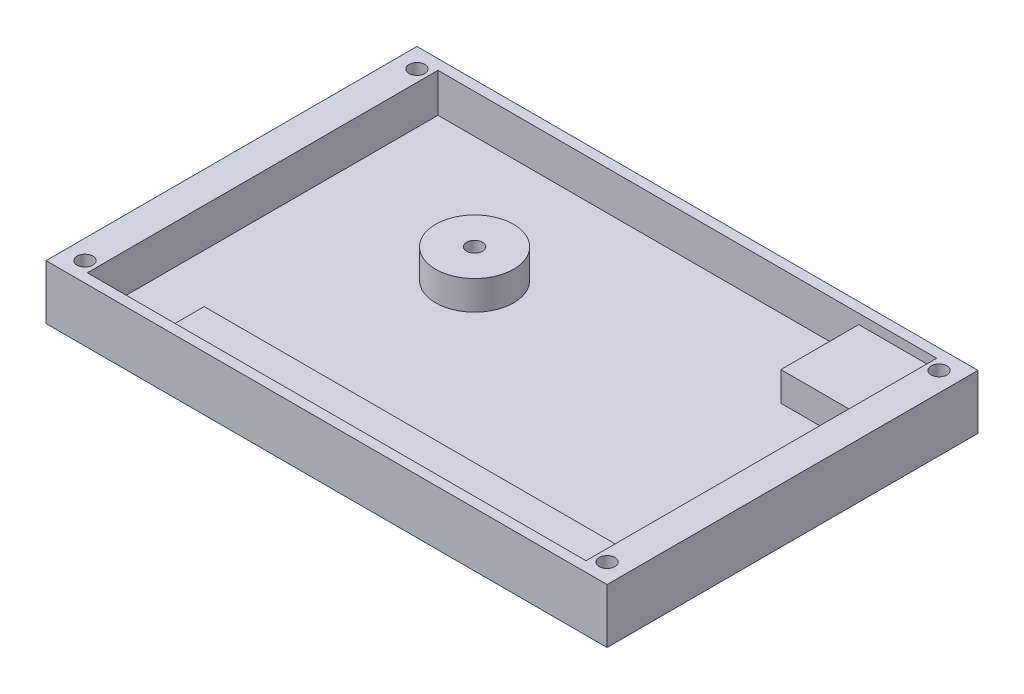
ISO-10303-21;
HEADER;
FILE_DESCRIPTION(('STEP AP214'),'2;1');
FILE_NAME('part.step','',(''),(''),'','','');
FILE_SCHEMA(('AUTOMOTIVE_DESIGN { 1 0 10303 214 1 1 1 1 }'));
ENDSEC;
DATA;
#1=APPLICATION_CONTEXT('core data for automotive mechanical design processes');
#2=APPLICATION_PROTOCOL_DEFINITION('international standard','automotive_design',2000,#1);
#3=PRODUCT_CONTEXT('',#1,'mechanical');
#4=PRODUCT('Part','Part','',(#3));
#5=PRODUCT_RELATED_PRODUCT_CATEGORY('part','',(#4));
#6=PRODUCT_DEFINITION_FORMATION('','',#4);
#7=PRODUCT_DEFINITION_CONTEXT('part definition',#1,'design');
#8=PRODUCT_DEFINITION('design','',#6,#7);
#9=PRODUCT_DEFINITION_SHAPE('','',#8);
#10=(LENGTH_UNIT() NAMED_UNIT(*) SI_UNIT(.MILLI.,.METRE.));
#11=(NAMED_UNIT(*) PLANE_ANGLE_UNIT() SI_UNIT($,.RADIAN.));
#12=(NAMED_UNIT(*) SI_UNIT($,.STERADIAN.) SOLID_ANGLE_UNIT());
#13=UNCERTAINTY_MEASURE_WITH_UNIT(LENGTH_MEASURE(1.E-05),#10,'distance_accuracy_value','');
#14=(GEOMETRIC_REPRESENTATION_CONTEXT(3) GLOBAL_UNCERTAINTY_ASSIGNED_CONTEXT((#13)) GLOBAL_UNIT_ASSIGNED_CONTEXT((#10,
#11,#12)) REPRESENTATION_CONTEXT('',''));
#15=CARTESIAN_POINT('',(0.,0.,0.));
#16=DIRECTION('',(0.,0.,1.));
#17=DIRECTION('',(1.,0.,0.));
#18=AXIS2_PLACEMENT_3D('',#15,#16,#17);
#19=CARTESIAN_POINT('',(0.,7.2898,0.));
#20=DIRECTION('',(0.,-1.,0.));
#21=DIRECTION('',(0.,0.,-1.));
#22=AXIS2_PLACEMENT_3D('',#19,#20,#21);
#23=PLANE('',#22);
#24=DIRECTION('',(1.,0.,0.));
#25=VECTOR('',#24,1.);
#26=CARTESIAN_POINT('',(0.,7.2898,22.225));
#27=LINE('',#26,#25);
#28=CARTESIAN_POINT('',(-27.94,7.2898,22.225));
#29=VERTEX_POINT('',#28);
#30=CARTESIAN_POINT('',(40.64,7.2898,22.225));
#31=VERTEX_POINT('',#30);
#32=EDGE_CURVE('E324',#29,#31,#27,.T.);
#33=ORIENTED_EDGE('',*,*,#32,.F.);
#34=DIRECTION('',(0.,0.,1.));
#35=VECTOR('',#34,1.);
#36=CARTESIAN_POINT('',(-27.94,7.2898,0.));
#37=LINE('',#36,#35);
#38=CARTESIAN_POINT('',(-27.94,7.2898,28.575));
#39=VERTEX_POINT('',#38);
#40=EDGE_CURVE('E192',#29,#39,#37,.T.);
#41=ORIENTED_EDGE('',*,*,#40,.T.);
#42=DIRECTION('',(1.,0.,0.));
#43=VECTOR('',#42,1.);
#44=CARTESIAN_POINT('',(40.64,7.2898,28.575));
#45=LINE('',#44,#43);
#46=CARTESIAN_POINT('',(40.64,7.2898,28.575));
#47=VERTEX_POINT('',#46);
#48=EDGE_CURVE('E208',#39,#47,#45,.T.);
#49=ORIENTED_EDGE('',*,*,#48,.T.);
#50=DIRECTION('',(0.,0.,-1.));
#51=VECTOR('',#50,1.);
#52=CARTESIAN_POINT('',(40.64,7.2898,-28.575));
#53=LINE('',#52,#51);
#54=EDGE_CURVE('E213',#47,#31,#53,.T.);
#55=ORIENTED_EDGE('',*,*,#54,.T.);
#56=EDGE_LOOP('',(#33,#41,#49,#55));
#57=FACE_BOUND('',#56,.T.);
#58=ADVANCED_FACE('F62',(#57),#23,.F.);
#59=CARTESIAN_POINT('',(-45.72,8.89,-30.226));
#60=DIRECTION('',(1.,0.,0.));
#61=DIRECTION('',(0.,0.,-1.));
#62=AXIS2_PLACEMENT_3D('',#59,#60,#61);
#63=PLANE('',#62);
#64=DIRECTION('',(0.,0.,1.));
#65=VECTOR('',#64,1.);
#66=CARTESIAN_POINT('',(-45.72,0.,-30.226));
#67=LINE('',#66,#65);
#68=CARTESIAN_POINT('',(-45.72,0.,-30.226));
#69=VERTEX_POINT('',#68);
#70=CARTESIAN_POINT('',(-45.72,0.,30.226));
#71=VERTEX_POINT('',#70);
#72=EDGE_CURVE('E236',#69,#71,#67,.T.);
#73=ORIENTED_EDGE('',*,*,#72,.T.);
#74=DIRECTION('',(0.,-1.,0.));
#75=VECTOR('',#74,1.);
#76=CARTESIAN_POINT('',(-45.72,8.89,30.226));
#77=LINE('',#76,#75);
#78=CARTESIAN_POINT('',(-45.72,8.89,30.226));
#79=VERTEX_POINT('',#78);
#80=EDGE_CURVE('E13',#79,#71,#77,.T.);
#81=ORIENTED_EDGE('',*,*,#80,.F.);
#82=DIRECTION('',(0.,0.,1.));
#83=VECTOR('',#82,1.);
#84=CARTESIAN_POINT('',(-45.72,8.89,-30.226));
#85=LINE('',#84,#83);
#86=CARTESIAN_POINT('',(-45.72,8.89,-30.226));
#87=VERTEX_POINT('',#86);
#88=EDGE_CURVE('E242',#87,#79,#85,.T.);
#89=ORIENTED_EDGE('',*,*,#88,.F.);
#90=DIRECTION('',(0.,-1.,0.));
#91=VECTOR('',#90,1.);
#92=CARTESIAN_POINT('',(-45.72,8.89,-30.226));
#93=LINE('',#92,#91);
#94=EDGE_CURVE('E252',#87,#69,#93,.T.);
#95=ORIENTED_EDGE('',*,*,#94,.T.);
#96=EDGE_LOOP('',(#73,#81,#89,#95));
#97=FACE_BOUND('',#96,.T.);
#98=ADVANCED_FACE('F64',(#97),#63,.F.);
#99=CARTESIAN_POINT('',(45.72,8.89,30.226));
#100=DIRECTION('',(0.,0.,-1.));
#101=DIRECTION('',(-1.,0.,0.));
#102=AXIS2_PLACEMENT_3D('',#99,#100,#101);
#103=PLANE('',#102);
#104=DIRECTION('',(1.,0.,0.));
#105=VECTOR('',#104,1.);
#106=CARTESIAN_POINT('',(45.72,0.,30.226));
#107=LINE('',#106,#105);
#108=CARTESIAN_POINT('',(45.72,0.,30.226));
#109=VERTEX_POINT('',#108);
#110=EDGE_CURVE('E255',#71,#109,#107,.T.);
#111=ORIENTED_EDGE('',*,*,#110,.T.);
#112=DIRECTION('',(0.,-1.,0.));
#113=VECTOR('',#112,1.);
#114=CARTESIAN_POINT('',(45.72,8.89,30.226));
#115=LINE('',#114,#113);
#116=CARTESIAN_POINT('',(45.72,8.89,30.226));
#117=VERTEX_POINT('',#116);
#118=EDGE_CURVE('E72',#117,#109,#115,.T.);
#119=ORIENTED_EDGE('',*,*,#118,.F.);
#120=DIRECTION('',(1.,0.,0.));
#121=VECTOR('',#120,1.);
#122=CARTESIAN_POINT('',(45.72,8.89,30.226));
#123=LINE('',#122,#121);
#124=EDGE_CURVE('E245',#79,#117,#123,.T.);
#125=ORIENTED_EDGE('',*,*,#124,.F.);
#126=ORIENTED_EDGE('',*,*,#80,.T.);
#127=EDGE_LOOP('',(#111,#119,#125,#126));
#128=FACE_BOUND('',#127,.T.);
#129=ADVANCED_FACE('F285',(#128),#103,.F.);
#130=CARTESIAN_POINT('',(45.72,8.89,-30.226));
#131=DIRECTION('',(-1.,0.,0.));
#132=DIRECTION('',(0.,0.,1.));
#133=AXIS2_PLACEMENT_3D('',#130,#131,#132);
#134=PLANE('',#133);
#135=DIRECTION('',(0.,0.,-1.));
#136=VECTOR('',#135,1.);
#137=CARTESIAN_POINT('',(45.72,0.,-30.226));
#138=LINE('',#137,#136);
#139=CARTESIAN_POINT('',(45.72,0.,-30.226));
#140=VERTEX_POINT('',#139);
#141=EDGE_CURVE('E257',#109,#140,#138,.T.);
#142=ORIENTED_EDGE('',*,*,#141,.T.);
#143=DIRECTION('',(0.,-1.,0.));
#144=VECTOR('',#143,1.);
#145=CARTESIAN_POINT('',(45.72,8.89,-30.226));
#146=LINE('',#145,#144);
#147=CARTESIAN_POINT('',(45.72,8.89,-30.226));
#148=VERTEX_POINT('',#147);
#149=EDGE_CURVE('E262',#148,#140,#146,.T.);
#150=ORIENTED_EDGE('',*,*,#149,.F.);
#151=DIRECTION('',(0.,0.,-1.));
#152=VECTOR('',#151,1.);
#153=CARTESIAN_POINT('',(45.72,8.89,-30.226));
#154=LINE('',#153,#152);
#155=EDGE_CURVE('E248',#117,#148,#154,.T.);
#156=ORIENTED_EDGE('',*,*,#155,.F.);
#157=ORIENTED_EDGE('',*,*,#118,.T.);
#158=EDGE_LOOP('',(#142,#150,#156,#157));
#159=FACE_BOUND('',#158,.T.);
#160=ADVANCED_FACE('F269',(#159),#134,.F.);
#161=CARTESIAN_POINT('',(45.72,8.89,-30.226));
#162=DIRECTION('',(0.,0.,1.));
#163=DIRECTION('',(1.,0.,0.));
#164=AXIS2_PLACEMENT_3D('',#161,#162,#163);
#165=PLANE('',#164);
#166=DIRECTION('',(-1.,0.,0.));
#167=VECTOR('',#166,1.);
#168=CARTESIAN_POINT('',(45.72,0.,-30.226));
#169=LINE('',#168,#167);
#170=EDGE_CURVE('E246',#140,#69,#169,.T.);
#171=ORIENTED_EDGE('',*,*,#170,.T.);
#172=ORIENTED_EDGE('',*,*,#94,.F.);
#173=DIRECTION('',(-1.,0.,0.));
#174=VECTOR('',#173,1.);
#175=CARTESIAN_POINT('',(45.72,8.89,-30.226));
#176=LINE('',#175,#174);
#177=EDGE_CURVE('E250',#148,#87,#176,.T.);
#178=ORIENTED_EDGE('',*,*,#177,.F.);
#179=ORIENTED_EDGE('',*,*,#149,.T.);
#180=EDGE_LOOP('',(#171,#172,#178,#179));
#181=FACE_BOUND('',#180,.T.);
#182=ADVANCED_FACE('F278',(#181),#165,.F.);
#183=CARTESIAN_POINT('',(0.,8.89,0.));
#184=DIRECTION('',(0.,-1.,0.));
#185=DIRECTION('',(0.,0.,-1.));
#186=AXIS2_PLACEMENT_3D('',#183,#184,#185);
#187=PLANE('',#186);
#188=CARTESIAN_POINT('',(42.545,8.89,-27.051));
#189=DIRECTION('',(0.,1.,0.));
#190=DIRECTION('',(0.,0.,1.));
#191=AXIS2_PLACEMENT_3D('',#188,#189,#190);
#192=CIRCLE('',#191,1.28905);
#193=CARTESIAN_POINT('',(42.545,8.89,-25.76195));
#194=VERTEX_POINT('',#193);
#195=EDGE_CURVE('E522',#194,#194,#192,.T.);
#196=ORIENTED_EDGE('',*,*,#195,.F.);
#197=EDGE_LOOP('',(#196));
#198=FACE_BOUND('',#197,.T.);
#199=CARTESIAN_POINT('',(42.545,8.89,27.051));
#200=DIRECTION('',(0.,1.,0.));
#201=DIRECTION('',(0.,0.,1.));
#202=AXIS2_PLACEMENT_3D('',#199,#200,#201);
#203=CIRCLE('',#202,1.28905);
#204=CARTESIAN_POINT('',(42.545,8.89,28.34005));
#205=VERTEX_POINT('',#204);
#206=EDGE_CURVE('E524',#205,#205,#203,.T.);
#207=ORIENTED_EDGE('',*,*,#206,.F.);
#208=EDGE_LOOP('',(#207));
#209=FACE_BOUND('',#208,.T.);
#210=CARTESIAN_POINT('',(-42.545,8.89,27.051));
#211=DIRECTION('',(0.,1.,0.));
#212=DIRECTION('',(0.,0.,1.));
#213=AXIS2_PLACEMENT_3D('',#210,#211,#212);
#214=CIRCLE('',#213,1.28905);
#215=CARTESIAN_POINT('',(-42.545,8.89,28.34005));
#216=VERTEX_POINT('',#215);
#217=EDGE_CURVE('E530',#216,#216,#214,.T.);
#218=ORIENTED_EDGE('',*,*,#217,.F.);
#219=EDGE_LOOP('',(#218));
#220=FACE_BOUND('',#219,.T.);
#221=CARTESIAN_POINT('',(-42.545,8.89,-27.051));
#222=DIRECTION('',(0.,1.,0.));
#223=DIRECTION('',(0.,0.,1.));
#224=AXIS2_PLACEMENT_3D('',#221,#222,#223);
#225=CIRCLE('',#224,1.28905);
#226=CARTESIAN_POINT('',(-42.545,8.89,-25.76195));
#227=VERTEX_POINT('',#226);
#228=EDGE_CURVE('E536',#227,#227,#225,.T.);
#229=ORIENTED_EDGE('',*,*,#228,.F.);
#230=EDGE_LOOP('',(#229));
#231=FACE_BOUND('',#230,.T.);
#232=DIRECTION('',(1.,0.,0.));
#233=VECTOR('',#232,1.);
#234=CARTESIAN_POINT('',(40.64,8.89,28.575));
#235=LINE('',#234,#233);
#236=CARTESIAN_POINT('',(-40.64,8.89,28.575));
#237=VERTEX_POINT('',#236);
#238=CARTESIAN_POINT('',(40.64,8.89,28.575));
#239=VERTEX_POINT('',#238);
#240=EDGE_CURVE('E226',#237,#239,#235,.T.);
#241=ORIENTED_EDGE('',*,*,#240,.F.);
#242=DIRECTION('',(0.,0.,1.));
#243=VECTOR('',#242,1.);
#244=CARTESIAN_POINT('',(-40.64,8.89,-28.575));
#245=LINE('',#244,#243);
#246=CARTESIAN_POINT('',(-40.64,8.89,-28.575));
#247=VERTEX_POINT('',#246);
#248=EDGE_CURVE('E87',#247,#237,#245,.T.);
#249=ORIENTED_EDGE('',*,*,#248,.F.);
#250=DIRECTION('',(-1.,0.,0.));
#251=VECTOR('',#250,1.);
#252=CARTESIAN_POINT('',(40.64,8.89,-28.575));
#253=LINE('',#252,#251);
#254=CARTESIAN_POINT('',(40.64,8.89,-28.575));
#255=VERTEX_POINT('',#254);
#256=EDGE_CURVE('E211',#255,#247,#253,.T.);
#257=ORIENTED_EDGE('',*,*,#256,.F.);
#258=DIRECTION('',(0.,0.,-1.));
#259=VECTOR('',#258,1.);
#260=CARTESIAN_POINT('',(40.64,8.89,-28.575));
#261=LINE('',#260,#259);
#262=EDGE_CURVE('E229',#239,#255,#261,.T.);
#263=ORIENTED_EDGE('',*,*,#262,.F.);
#264=EDGE_LOOP('',(#241,#249,#257,#263));
#265=FACE_BOUND('',#264,.T.);
#266=ORIENTED_EDGE('',*,*,#88,.T.);
#267=ORIENTED_EDGE('',*,*,#124,.T.);
#268=ORIENTED_EDGE('',*,*,#155,.T.);
#269=ORIENTED_EDGE('',*,*,#177,.T.);
#270=EDGE_LOOP('',(#266,#267,#268,#269));
#271=FACE_BOUND('',#270,.T.);
#272=ADVANCED_FACE('F284',(#198,#209,#220,#231,#265,#271),#187,.F.);
#273=CARTESIAN_POINT('',(0.,0.,0.));
#274=DIRECTION('',(0.,-1.,0.));
#275=DIRECTION('',(0.,0.,-1.));
#276=AXIS2_PLACEMENT_3D('',#273,#274,#275);
#277=PLANE('',#276);
#278=CARTESIAN_POINT('',(42.545,0.,-27.051));
#279=DIRECTION('',(0.,1.,0.));
#280=DIRECTION('',(0.,0.,1.));
#281=AXIS2_PLACEMENT_3D('',#278,#279,#280);
#282=CIRCLE('',#281,1.28905);
#283=CARTESIAN_POINT('',(42.545,0.,-25.76195));
#284=VERTEX_POINT('',#283);
#285=EDGE_CURVE('E519',#284,#284,#282,.T.);
#286=ORIENTED_EDGE('',*,*,#285,.T.);
#287=EDGE_LOOP('',(#286));
#288=FACE_BOUND('',#287,.T.);
#289=CARTESIAN_POINT('',(42.545,0.,27.051));
#290=DIRECTION('',(0.,1.,0.));
#291=DIRECTION('',(0.,0.,1.));
#292=AXIS2_PLACEMENT_3D('',#289,#290,#291);
#293=CIRCLE('',#292,1.28905);
#294=CARTESIAN_POINT('',(42.545,0.,28.34005));
#295=VERTEX_POINT('',#294);
#296=EDGE_CURVE('E527',#295,#295,#293,.T.);
#297=ORIENTED_EDGE('',*,*,#296,.T.);
#298=EDGE_LOOP('',(#297));
#299=FACE_BOUND('',#298,.T.);
#300=CARTESIAN_POINT('',(-42.545,0.,27.051));
#301=DIRECTION('',(0.,1.,0.));
#302=DIRECTION('',(0.,0.,1.));
#303=AXIS2_PLACEMENT_3D('',#300,#301,#302);
#304=CIRCLE('',#303,1.28905);
#305=CARTESIAN_POINT('',(-42.545,0.,28.34005));
#306=VERTEX_POINT('',#305);
#307=EDGE_CURVE('E533',#306,#306,#304,.T.);
#308=ORIENTED_EDGE('',*,*,#307,.T.);
#309=EDGE_LOOP('',(#308));
#310=FACE_BOUND('',#309,.T.);
#311=CARTESIAN_POINT('',(-42.545,0.,-27.051));
#312=DIRECTION('',(0.,1.,0.));
#313=DIRECTION('',(0.,0.,1.));
#314=AXIS2_PLACEMENT_3D('',#311,#312,#313);
#315=CIRCLE('',#314,1.28905);
#316=CARTESIAN_POINT('',(-42.545,0.,-25.76195));
#317=VERTEX_POINT('',#316);
#318=EDGE_CURVE('E539',#317,#317,#315,.T.);
#319=ORIENTED_EDGE('',*,*,#318,.T.);
#320=EDGE_LOOP('',(#319));
#321=FACE_BOUND('',#320,.T.);
#322=ORIENTED_EDGE('',*,*,#72,.F.);
#323=ORIENTED_EDGE('',*,*,#170,.F.);
#324=ORIENTED_EDGE('',*,*,#141,.F.);
#325=ORIENTED_EDGE('',*,*,#110,.F.);
#326=EDGE_LOOP('',(#322,#323,#324,#325));
#327=FACE_BOUND('',#326,.T.);
#328=ADVANCED_FACE('F275',(#288,#299,#310,#321,#327),#277,.T.);
#329=CARTESIAN_POINT('',(-40.64,7.2898,-28.575));
#330=DIRECTION('',(-1.,0.,0.));
#331=DIRECTION('',(0.,0.,1.));
#332=AXIS2_PLACEMENT_3D('',#329,#330,#331);
#333=PLANE('',#332);
#334=ORIENTED_EDGE('',*,*,#248,.T.);
#335=DIRECTION('',(0.,1.,0.));
#336=VECTOR('',#335,1.);
#337=CARTESIAN_POINT('',(-40.64,7.2898,28.575));
#338=LINE('',#337,#336);
#339=CARTESIAN_POINT('',(-40.64,2.54,28.575));
#340=VERTEX_POINT('',#339);
#341=EDGE_CURVE('E220',#340,#237,#338,.T.);
#342=ORIENTED_EDGE('',*,*,#341,.F.);
#343=DIRECTION('',(0.,0.,1.));
#344=VECTOR('',#343,1.);
#345=CARTESIAN_POINT('',(-40.64,2.54,0.));
#346=LINE('',#345,#344);
#347=CARTESIAN_POINT('',(-40.64,2.54,-28.575));
#348=VERTEX_POINT('',#347);
#349=EDGE_CURVE('E373',#348,#340,#346,.T.);
#350=ORIENTED_EDGE('',*,*,#349,.F.);
#351=DIRECTION('',(0.,1.,0.));
#352=VECTOR('',#351,1.);
#353=CARTESIAN_POINT('',(-40.64,7.2898,-28.575));
#354=LINE('',#353,#352);
#355=EDGE_CURVE('E234',#348,#247,#354,.T.);
#356=ORIENTED_EDGE('',*,*,#355,.T.);
#357=EDGE_LOOP('',(#334,#342,#350,#356));
#358=FACE_BOUND('',#357,.T.);
#359=ADVANCED_FACE('F377',(#358),#333,.F.);
#360=CARTESIAN_POINT('',(40.64,7.2898,-28.575));
#361=DIRECTION('',(0.,0.,-1.));
#362=DIRECTION('',(-1.,0.,0.));
#363=AXIS2_PLACEMENT_3D('',#360,#361,#362);
#364=PLANE('',#363);
#365=ORIENTED_EDGE('',*,*,#256,.T.);
#366=ORIENTED_EDGE('',*,*,#355,.F.);
#367=DIRECTION('',(-1.,0.,0.));
#368=VECTOR('',#367,1.);
#369=CARTESIAN_POINT('',(0.,2.54,-28.575));
#370=LINE('',#369,#368);
#371=CARTESIAN_POINT('',(27.94,2.54,-28.575));
#372=VERTEX_POINT('',#371);
#373=EDGE_CURVE('E370',#372,#348,#370,.T.);
#374=ORIENTED_EDGE('',*,*,#373,.F.);
#375=DIRECTION('',(0.,1.,0.));
#376=VECTOR('',#375,1.);
#377=CARTESIAN_POINT('',(27.94,-99.3607613698687,-28.575));
#378=LINE('',#377,#376);
#379=CARTESIAN_POINT('',(27.94,7.2898,-28.575));
#380=VERTEX_POINT('',#379);
#381=EDGE_CURVE('E221',#372,#380,#378,.T.);
#382=ORIENTED_EDGE('',*,*,#381,.T.);
#383=DIRECTION('',(-1.,0.,0.));
#384=VECTOR('',#383,1.);
#385=CARTESIAN_POINT('',(40.64,7.2898,-28.575));
#386=LINE('',#385,#384);
#387=CARTESIAN_POINT('',(40.64,7.2898,-28.575));
#388=VERTEX_POINT('',#387);
#389=EDGE_CURVE('E216',#388,#380,#386,.T.);
#390=ORIENTED_EDGE('',*,*,#389,.F.);
#391=DIRECTION('',(0.,1.,0.));
#392=VECTOR('',#391,1.);
#393=CARTESIAN_POINT('',(40.64,7.2898,-28.575));
#394=LINE('',#393,#392);
#395=EDGE_CURVE('E237',#388,#255,#394,.T.);
#396=ORIENTED_EDGE('',*,*,#395,.T.);
#397=EDGE_LOOP('',(#365,#366,#374,#382,#390,#396));
#398=FACE_BOUND('',#397,.T.);
#399=ADVANCED_FACE('F381',(#398),#364,.F.);
#400=CARTESIAN_POINT('',(40.64,7.2898,-28.575));
#401=DIRECTION('',(1.,0.,0.));
#402=DIRECTION('',(0.,0.,-1.));
#403=AXIS2_PLACEMENT_3D('',#400,#401,#402);
#404=PLANE('',#403);
#405=ORIENTED_EDGE('',*,*,#262,.T.);
#406=ORIENTED_EDGE('',*,*,#395,.F.);
#407=CARTESIAN_POINT('',(40.64,7.2898,-15.875));
#408=VERTEX_POINT('',#407);
#409=EDGE_CURVE('E210',#408,#388,#53,.T.);
#410=ORIENTED_EDGE('',*,*,#409,.F.);
#411=DIRECTION('',(0.,1.,0.));
#412=VECTOR('',#411,1.);
#413=CARTESIAN_POINT('',(40.64,-99.3607613698687,-15.875));
#414=LINE('',#413,#412);
#415=CARTESIAN_POINT('',(40.64,2.54,-15.875));
#416=VERTEX_POINT('',#415);
#417=EDGE_CURVE('E196',#416,#408,#414,.T.);
#418=ORIENTED_EDGE('',*,*,#417,.F.);
#419=DIRECTION('',(0.,0.,-1.));
#420=VECTOR('',#419,1.);
#421=CARTESIAN_POINT('',(40.64,2.54,0.));
#422=LINE('',#421,#420);
#423=CARTESIAN_POINT('',(40.64,2.54,22.225));
#424=VERTEX_POINT('',#423);
#425=EDGE_CURVE('E357',#424,#416,#422,.T.);
#426=ORIENTED_EDGE('',*,*,#425,.F.);
#427=DIRECTION('',(0.,1.,0.));
#428=VECTOR('',#427,1.);
#429=CARTESIAN_POINT('',(40.64,-99.3607613698687,22.225));
#430=LINE('',#429,#428);
#431=EDGE_CURVE('E173',#424,#31,#430,.T.);
#432=ORIENTED_EDGE('',*,*,#431,.T.);
#433=ORIENTED_EDGE('',*,*,#54,.F.);
#434=DIRECTION('',(0.,1.,0.));
#435=VECTOR('',#434,1.);
#436=CARTESIAN_POINT('',(40.64,7.2898,28.575));
#437=LINE('',#436,#435);
#438=EDGE_CURVE('E239',#47,#239,#437,.T.);
#439=ORIENTED_EDGE('',*,*,#438,.T.);
#440=EDGE_LOOP('',(#405,#406,#410,#418,#426,#432,#433,#439));
#441=FACE_BOUND('',#440,.T.);
#442=ADVANCED_FACE('F356',(#441),#404,.F.);
#443=CARTESIAN_POINT('',(40.64,7.2898,28.575));
#444=DIRECTION('',(0.,0.,1.));
#445=DIRECTION('',(1.,0.,0.));
#446=AXIS2_PLACEMENT_3D('',#443,#444,#445);
#447=PLANE('',#446);
#448=ORIENTED_EDGE('',*,*,#240,.T.);
#449=ORIENTED_EDGE('',*,*,#438,.F.);
#450=ORIENTED_EDGE('',*,*,#48,.F.);
#451=DIRECTION('',(0.,1.,0.));
#452=VECTOR('',#451,1.);
#453=CARTESIAN_POINT('',(-27.94,-99.3607613698687,28.575));
#454=LINE('',#453,#452);
#455=CARTESIAN_POINT('',(-27.94,2.54,28.575));
#456=VERTEX_POINT('',#455);
#457=EDGE_CURVE('E177',#456,#39,#454,.T.);
#458=ORIENTED_EDGE('',*,*,#457,.F.);
#459=DIRECTION('',(1.,0.,0.));
#460=VECTOR('',#459,1.);
#461=CARTESIAN_POINT('',(0.,2.54,28.575));
#462=LINE('',#461,#460);
#463=EDGE_CURVE('E185',#340,#456,#462,.T.);
#464=ORIENTED_EDGE('',*,*,#463,.F.);
#465=ORIENTED_EDGE('',*,*,#341,.T.);
#466=EDGE_LOOP('',(#448,#449,#450,#458,#464,#465));
#467=FACE_BOUND('',#466,.T.);
#468=ADVANCED_FACE('F303',(#467),#447,.F.);
#469=DIRECTION('',(0.,0.,1.));
#470=VECTOR('',#469,1.);
#471=CARTESIAN_POINT('',(27.94,7.2898,0.));
#472=LINE('',#471,#470);
#473=CARTESIAN_POINT('',(27.94,7.2898,-15.875));
#474=VERTEX_POINT('',#473);
#475=EDGE_CURVE('E194',#380,#474,#472,.T.);
#476=ORIENTED_EDGE('',*,*,#475,.T.);
#477=DIRECTION('',(1.,0.,0.));
#478=VECTOR('',#477,1.);
#479=CARTESIAN_POINT('',(0.,7.2898,-15.875));
#480=LINE('',#479,#478);
#481=EDGE_CURVE('E66',#474,#408,#480,.T.);
#482=ORIENTED_EDGE('',*,*,#481,.T.);
#483=ORIENTED_EDGE('',*,*,#409,.T.);
#484=ORIENTED_EDGE('',*,*,#389,.T.);
#485=EDGE_LOOP('',(#476,#482,#483,#484));
#486=FACE_BOUND('',#485,.T.);
#487=ADVANCED_FACE('F295',(#486),#23,.F.);
#488=CARTESIAN_POINT('',(-14.351,-99.3607613698687,-8.25499999999997));
#489=DIRECTION('',(0.,1.,0.));
#490=DIRECTION('',(0.,0.,1.));
#491=AXIS2_PLACEMENT_3D('',#488,#489,#490);
#492=CYLINDRICAL_SURFACE('',#491,6.35);
#493=CARTESIAN_POINT('',(-14.351,7.2898,-8.25499999999997));
#494=DIRECTION('',(0.,1.,0.));
#495=DIRECTION('',(0.,0.,1.));
#496=AXIS2_PLACEMENT_3D('',#493,#494,#495);
#497=CIRCLE('',#496,6.35);
#498=CARTESIAN_POINT('',(-14.351,7.2898,-1.90499999999997));
#499=VERTEX_POINT('',#498);
#500=EDGE_CURVE('E188',#499,#499,#497,.T.);
#501=ORIENTED_EDGE('',*,*,#500,.F.);
#502=EDGE_LOOP('',(#501));
#503=FACE_BOUND('',#502,.T.);
#504=CARTESIAN_POINT('',(-14.351,2.54,-8.25499999999997));
#505=DIRECTION('',(0.,-1.,0.));
#506=DIRECTION('',(0.,0.,-1.));
#507=AXIS2_PLACEMENT_3D('',#504,#505,#506);
#508=CIRCLE('',#507,6.35);
#509=CARTESIAN_POINT('',(-14.351,2.54,-14.605));
#510=VERTEX_POINT('',#509);
#511=EDGE_CURVE('E176',#510,#510,#508,.F.);
#512=ORIENTED_EDGE('',*,*,#511,.T.);
#513=EDGE_LOOP('',(#512));
#514=FACE_BOUND('',#513,.T.);
#515=ADVANCED_FACE('F302',(#503,#514),#492,.T.);
#516=CARTESIAN_POINT('',(0.,-99.3607613698687,22.225));
#517=DIRECTION('',(0.,0.,1.));
#518=DIRECTION('',(1.,0.,0.));
#519=AXIS2_PLACEMENT_3D('',#516,#517,#518);
#520=PLANE('',#519);
#521=DIRECTION('',(0.,1.,0.));
#522=VECTOR('',#521,1.);
#523=CARTESIAN_POINT('',(-27.94,-99.3607613698687,22.225));
#524=LINE('',#523,#522);
#525=CARTESIAN_POINT('',(-27.94,2.54,22.225));
#526=VERTEX_POINT('',#525);
#527=EDGE_CURVE('E171',#526,#29,#524,.T.);
#528=ORIENTED_EDGE('',*,*,#527,.T.);
#529=ORIENTED_EDGE('',*,*,#32,.T.);
#530=ORIENTED_EDGE('',*,*,#431,.F.);
#531=DIRECTION('',(1.,0.,0.));
#532=VECTOR('',#531,1.);
#533=CARTESIAN_POINT('',(0.,2.54,22.225));
#534=LINE('',#533,#532);
#535=EDGE_CURVE('E166',#526,#424,#534,.T.);
#536=ORIENTED_EDGE('',*,*,#535,.F.);
#537=EDGE_LOOP('',(#528,#529,#530,#536));
#538=FACE_BOUND('',#537,.T.);
#539=ADVANCED_FACE('F168',(#538),#520,.F.);
#540=CARTESIAN_POINT('',(0.,-99.3607613698687,-15.875));
#541=DIRECTION('',(0.,0.,1.));
#542=DIRECTION('',(1.,0.,0.));
#543=AXIS2_PLACEMENT_3D('',#540,#541,#542);
#544=PLANE('',#543);
#545=DIRECTION('',(1.,0.,0.));
#546=VECTOR('',#545,1.);
#547=CARTESIAN_POINT('',(0.,2.54,-15.875));
#548=LINE('',#547,#546);
#549=CARTESIAN_POINT('',(27.94,2.54,-15.875));
#550=VERTEX_POINT('',#549);
#551=EDGE_CURVE('E360',#550,#416,#548,.T.);
#552=ORIENTED_EDGE('',*,*,#551,.T.);
#553=ORIENTED_EDGE('',*,*,#417,.T.);
#554=ORIENTED_EDGE('',*,*,#481,.F.);
#555=DIRECTION('',(0.,1.,0.));
#556=VECTOR('',#555,1.);
#557=CARTESIAN_POINT('',(27.94,-99.3607613698687,-15.875));
#558=LINE('',#557,#556);
#559=EDGE_CURVE('E201',#550,#474,#558,.T.);
#560=ORIENTED_EDGE('',*,*,#559,.F.);
#561=EDGE_LOOP('',(#552,#553,#554,#560));
#562=FACE_BOUND('',#561,.T.);
#563=ADVANCED_FACE('F383',(#562),#544,.T.);
#564=CARTESIAN_POINT('',(27.94,-99.3607613698687,0.));
#565=DIRECTION('',(-1.,0.,0.));
#566=DIRECTION('',(0.,0.,1.));
#567=AXIS2_PLACEMENT_3D('',#564,#565,#566);
#568=PLANE('',#567);
#569=DIRECTION('',(0.,0.,1.));
#570=VECTOR('',#569,1.);
#571=CARTESIAN_POINT('',(27.94,2.54,0.));
#572=LINE('',#571,#570);
#573=EDGE_CURVE('E363',#372,#550,#572,.T.);
#574=ORIENTED_EDGE('',*,*,#573,.T.);
#575=ORIENTED_EDGE('',*,*,#559,.T.);
#576=ORIENTED_EDGE('',*,*,#475,.F.);
#577=ORIENTED_EDGE('',*,*,#381,.F.);
#578=EDGE_LOOP('',(#574,#575,#576,#577));
#579=FACE_BOUND('',#578,.T.);
#580=ADVANCED_FACE('F382',(#579),#568,.T.);
#581=CARTESIAN_POINT('',(-27.94,-99.3607613698687,0.));
#582=DIRECTION('',(-1.,0.,0.));
#583=DIRECTION('',(0.,0.,1.));
#584=AXIS2_PLACEMENT_3D('',#581,#582,#583);
#585=PLANE('',#584);
#586=DIRECTION('',(0.,0.,1.));
#587=VECTOR('',#586,1.);
#588=CARTESIAN_POINT('',(-27.94,2.54,0.));
#589=LINE('',#588,#587);
#590=EDGE_CURVE('E180',#526,#456,#589,.T.);
#591=ORIENTED_EDGE('',*,*,#590,.T.);
#592=ORIENTED_EDGE('',*,*,#457,.T.);
#593=ORIENTED_EDGE('',*,*,#40,.F.);
#594=ORIENTED_EDGE('',*,*,#527,.F.);
#595=EDGE_LOOP('',(#591,#592,#593,#594));
#596=FACE_BOUND('',#595,.T.);
#597=ADVANCED_FACE('F190',(#596),#585,.T.);
#598=CARTESIAN_POINT('',(0.,2.54,0.));
#599=DIRECTION('',(0.,-1.,0.));
#600=DIRECTION('',(0.,0.,-1.));
#601=AXIS2_PLACEMENT_3D('',#598,#599,#600);
#602=PLANE('',#601);
#603=ORIENTED_EDGE('',*,*,#535,.T.);
#604=ORIENTED_EDGE('',*,*,#425,.T.);
#605=ORIENTED_EDGE('',*,*,#551,.F.);
#606=ORIENTED_EDGE('',*,*,#573,.F.);
#607=ORIENTED_EDGE('',*,*,#373,.T.);
#608=ORIENTED_EDGE('',*,*,#349,.T.);
#609=ORIENTED_EDGE('',*,*,#463,.T.);
#610=ORIENTED_EDGE('',*,*,#590,.F.);
#611=EDGE_LOOP('',(#603,#604,#605,#606,#607,#608,#609,#610));
#612=FACE_BOUND('',#611,.T.);
#613=ORIENTED_EDGE('',*,*,#511,.F.);
#614=EDGE_LOOP('',(#613));
#615=FACE_BOUND('',#614,.T.);
#616=ADVANCED_FACE('F181',(#612,#615),#602,.F.);
#617=CARTESIAN_POINT('',(-14.351,7.2898,-8.25499999999997));
#618=DIRECTION('',(0.,1.,0.));
#619=DIRECTION('',(0.,0.,1.));
#620=AXIS2_PLACEMENT_3D('',#617,#618,#619);
#621=CIRCLE('',#620,1.28905);
#622=CARTESIAN_POINT('',(-14.351,7.2898,-6.96594999999997));
#623=VERTEX_POINT('',#622);
#624=EDGE_CURVE('E319',#623,#623,#621,.T.);
#625=ORIENTED_EDGE('',*,*,#624,.F.);
#626=EDGE_LOOP('',(#625));
#627=FACE_BOUND('',#626,.T.);
#628=ORIENTED_EDGE('',*,*,#500,.T.);
#629=EDGE_LOOP('',(#628));
#630=FACE_BOUND('',#629,.T.);
#631=ADVANCED_FACE('F296',(#627,#630),#23,.F.);
#632=CARTESIAN_POINT('',(0.,2.54,0.));
#633=DIRECTION('',(0.,-1.,0.));
#634=DIRECTION('',(0.,0.,-1.));
#635=AXIS2_PLACEMENT_3D('',#632,#633,#634);
#636=PLANE('',#635);
#637=CARTESIAN_POINT('',(-14.351,2.54,-8.25499999999997));
#638=DIRECTION('',(0.,-1.,0.));
#639=DIRECTION('',(0.,0.,-1.));
#640=AXIS2_PLACEMENT_3D('',#637,#638,#639);
#641=CIRCLE('',#640,1.28905);
#642=CARTESIAN_POINT('',(-14.351,2.54,-9.54404999999997));
#643=VERTEX_POINT('',#642);
#644=EDGE_CURVE('E361',#643,#643,#641,.F.);
#645=ORIENTED_EDGE('',*,*,#644,.T.);
#646=EDGE_LOOP('',(#645));
#647=FACE_BOUND('',#646,.T.);
#648=ADVANCED_FACE('F306',(#647),#636,.F.);
#649=CARTESIAN_POINT('',(-14.351,-99.3607613698687,-8.25499999999997));
#650=DIRECTION('',(0.,1.,0.));
#651=DIRECTION('',(0.,0.,1.));
#652=AXIS2_PLACEMENT_3D('',#649,#650,#651);
#653=CYLINDRICAL_SURFACE('',#652,1.28905);
#654=ORIENTED_EDGE('',*,*,#624,.T.);
#655=EDGE_LOOP('',(#654));
#656=FACE_BOUND('',#655,.T.);
#657=ORIENTED_EDGE('',*,*,#644,.F.);
#658=EDGE_LOOP('',(#657));
#659=FACE_BOUND('',#658,.T.);
#660=ADVANCED_FACE('F312',(#656,#659),#653,.F.);
#661=CARTESIAN_POINT('',(-42.545,0.,-27.051));
#662=DIRECTION('',(0.,1.,0.));
#663=DIRECTION('',(0.,0.,1.));
#664=AXIS2_PLACEMENT_3D('',#661,#662,#663);
#665=CYLINDRICAL_SURFACE('',#664,1.28905);
#666=ORIENTED_EDGE('',*,*,#318,.F.);
#667=EDGE_LOOP('',(#666));
#668=FACE_BOUND('',#667,.T.);
#669=ORIENTED_EDGE('',*,*,#228,.T.);
#670=EDGE_LOOP('',(#669));
#671=FACE_BOUND('',#670,.T.);
#672=ADVANCED_FACE('F450',(#668,#671),#665,.F.);
#673=CARTESIAN_POINT('',(-42.545,0.,27.051));
#674=DIRECTION('',(0.,1.,0.));
#675=DIRECTION('',(0.,0.,1.));
#676=AXIS2_PLACEMENT_3D('',#673,#674,#675);
#677=CYLINDRICAL_SURFACE('',#676,1.28905);
#678=ORIENTED_EDGE('',*,*,#307,.F.);
#679=EDGE_LOOP('',(#678));
#680=FACE_BOUND('',#679,.T.);
#681=ORIENTED_EDGE('',*,*,#217,.T.);
#682=EDGE_LOOP('',(#681));
#683=FACE_BOUND('',#682,.T.);
#684=ADVANCED_FACE('F482',(#680,#683),#677,.F.);
#685=CARTESIAN_POINT('',(42.545,0.,27.051));
#686=DIRECTION('',(0.,1.,0.));
#687=DIRECTION('',(0.,0.,1.));
#688=AXIS2_PLACEMENT_3D('',#685,#686,#687);
#689=CYLINDRICAL_SURFACE('',#688,1.28905);
#690=ORIENTED_EDGE('',*,*,#296,.F.);
#691=EDGE_LOOP('',(#690));
#692=FACE_BOUND('',#691,.T.);
#693=ORIENTED_EDGE('',*,*,#206,.T.);
#694=EDGE_LOOP('',(#693));
#695=FACE_BOUND('',#694,.T.);
#696=ADVANCED_FACE('F492',(#692,#695),#689,.F.);
#697=CARTESIAN_POINT('',(42.545,0.,-27.051));
#698=DIRECTION('',(0.,1.,0.));
#699=DIRECTION('',(0.,0.,1.));
#700=AXIS2_PLACEMENT_3D('',#697,#698,#699);
#701=CYLINDRICAL_SURFACE('',#700,1.28905);
#702=ORIENTED_EDGE('',*,*,#285,.F.);
#703=EDGE_LOOP('',(#702));
#704=FACE_BOUND('',#703,.T.);
#705=ORIENTED_EDGE('',*,*,#195,.T.);
#706=EDGE_LOOP('',(#705));
#707=FACE_BOUND('',#706,.T.);
#708=ADVANCED_FACE('F502',(#704,#707),#701,.F.);
#709=CLOSED_SHELL('',(#58,#98,#129,#160,#182,#272,#328,#359,#399,#442,#468,#487,#515,#539,#563,
#580,#597,#616,#631,#648,#660,#672,#684,#696,#708));
#710=MANIFOLD_SOLID_BREP('B2',#709);
#711=ADVANCED_BREP_SHAPE_REPRESENTATION('',(#18,#710),#14);
#712=SHAPE_DEFINITION_REPRESENTATION(#9,#711);
ENDSEC;
END-ISO-10303-21;
